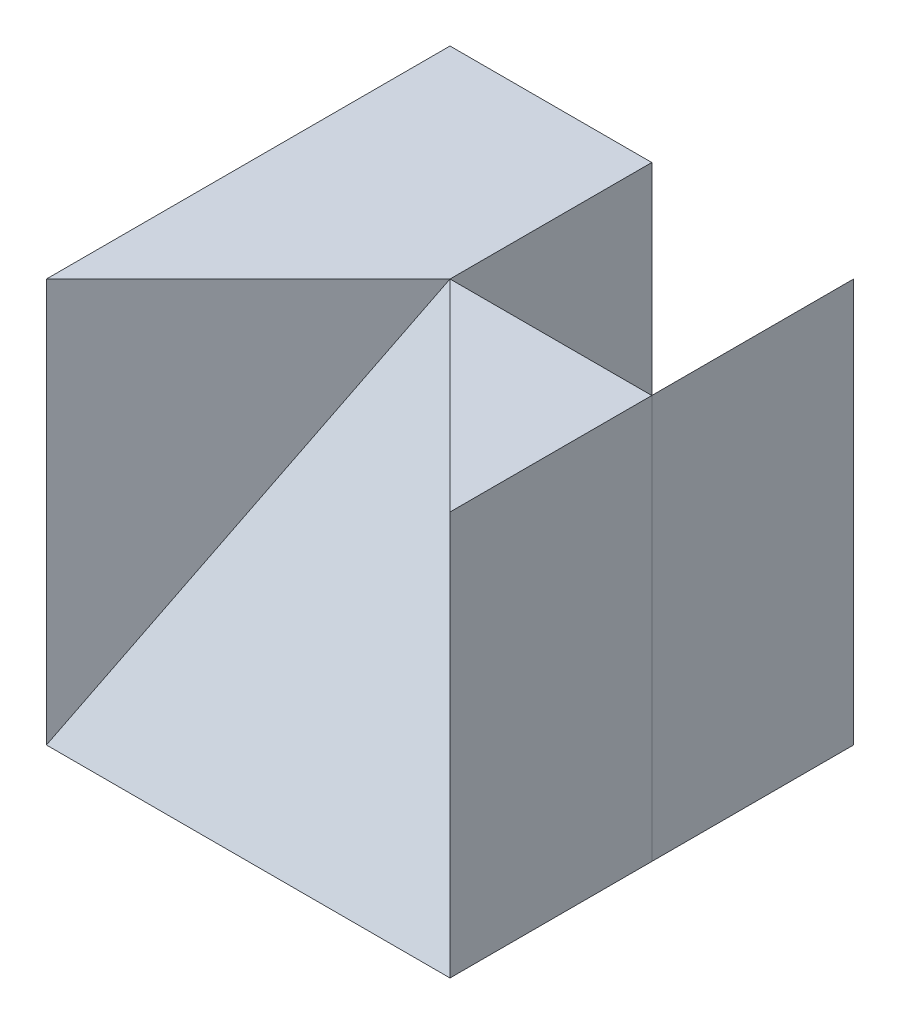
ISO-10303-21;
HEADER;
FILE_DESCRIPTION(('STEP AP214'),'2;1');
FILE_NAME('part.step','',(''),(''),'','','');
FILE_SCHEMA(('AUTOMOTIVE_DESIGN { 1 0 10303 214 1 1 1 1 }'));
ENDSEC;
DATA;
#1=APPLICATION_CONTEXT('core data for automotive mechanical design processes');
#2=APPLICATION_PROTOCOL_DEFINITION('international standard','automotive_design',2000,#1);
#3=PRODUCT_CONTEXT('',#1,'mechanical');
#4=PRODUCT('Part','Part','',(#3));
#5=PRODUCT_RELATED_PRODUCT_CATEGORY('part','',(#4));
#6=PRODUCT_DEFINITION_FORMATION('','',#4);
#7=PRODUCT_DEFINITION_CONTEXT('part definition',#1,'design');
#8=PRODUCT_DEFINITION('design','',#6,#7);
#9=PRODUCT_DEFINITION_SHAPE('','',#8);
#10=(LENGTH_UNIT() NAMED_UNIT(*) SI_UNIT(.MILLI.,.METRE.));
#11=(NAMED_UNIT(*) PLANE_ANGLE_UNIT() SI_UNIT($,.RADIAN.));
#12=(NAMED_UNIT(*) SI_UNIT($,.STERADIAN.) SOLID_ANGLE_UNIT());
#13=UNCERTAINTY_MEASURE_WITH_UNIT(LENGTH_MEASURE(1.E-05),#10,'distance_accuracy_value','');
#14=(GEOMETRIC_REPRESENTATION_CONTEXT(3) GLOBAL_UNCERTAINTY_ASSIGNED_CONTEXT((#13)) GLOBAL_UNIT_ASSIGNED_CONTEXT((#10,
#11,#12)) REPRESENTATION_CONTEXT('',''));
#15=CARTESIAN_POINT('',(0.,0.,0.));
#16=DIRECTION('',(0.,0.,1.));
#17=DIRECTION('',(1.,0.,0.));
#18=AXIS2_PLACEMENT_3D('',#15,#16,#17);
#19=CARTESIAN_POINT('',(2.,0.,-2.));
#20=DIRECTION('',(-1.,0.,0.));
#21=DIRECTION('',(0.,0.,1.));
#22=AXIS2_PLACEMENT_3D('',#19,#20,#21);
#23=PLANE('',#22);
#24=DIRECTION('',(0.,-1.,0.));
#25=VECTOR('',#24,1.);
#26=CARTESIAN_POINT('',(2.,0.,0.));
#27=LINE('',#26,#25);
#28=CARTESIAN_POINT('',(2.,4.,0.));
#29=VERTEX_POINT('',#28);
#30=CARTESIAN_POINT('',(2.,0.,0.));
#31=VERTEX_POINT('',#30);
#32=EDGE_CURVE('E93',#29,#31,#27,.T.);
#33=ORIENTED_EDGE('',*,*,#32,.T.);
#34=DIRECTION('',(0.,0.,1.));
#35=VECTOR('',#34,1.);
#36=CARTESIAN_POINT('',(2.,0.,-2.));
#37=LINE('',#36,#35);
#38=CARTESIAN_POINT('',(2.,0.,-2.));
#39=VERTEX_POINT('',#38);
#40=EDGE_CURVE('E13',#39,#31,#37,.T.);
#41=ORIENTED_EDGE('',*,*,#40,.F.);
#42=DIRECTION('',(0.,-1.,0.));
#43=VECTOR('',#42,1.);
#44=CARTESIAN_POINT('',(2.,0.,-2.));
#45=LINE('',#44,#43);
#46=CARTESIAN_POINT('',(2.,4.,-2.));
#47=VERTEX_POINT('',#46);
#48=EDGE_CURVE('E86',#47,#39,#45,.T.);
#49=ORIENTED_EDGE('',*,*,#48,.F.);
#50=DIRECTION('',(0.,0.,1.));
#51=VECTOR('',#50,1.);
#52=CARTESIAN_POINT('',(2.,4.,-2.));
#53=LINE('',#52,#51);
#54=EDGE_CURVE('E94',#47,#29,#53,.T.);
#55=ORIENTED_EDGE('',*,*,#54,.T.);
#56=EDGE_LOOP('',(#33,#41,#49,#55));
#57=FACE_BOUND('',#56,.T.);
#58=ADVANCED_FACE('F46',(#57),#23,.F.);
#59=CARTESIAN_POINT('',(0.,0.,-2.));
#60=DIRECTION('',(0.,1.,0.));
#61=DIRECTION('',(0.,0.,1.));
#62=AXIS2_PLACEMENT_3D('',#59,#60,#61);
#63=PLANE('',#62);
#64=DIRECTION('',(-1.,0.,0.));
#65=VECTOR('',#64,1.);
#66=CARTESIAN_POINT('',(0.,0.,0.));
#67=LINE('',#66,#65);
#68=CARTESIAN_POINT('',(0.,0.,0.));
#69=VERTEX_POINT('',#68);
#70=EDGE_CURVE('E74',#31,#69,#67,.T.);
#71=ORIENTED_EDGE('',*,*,#70,.T.);
#72=DIRECTION('',(0.,0.,1.));
#73=VECTOR('',#72,1.);
#74=CARTESIAN_POINT('',(0.,0.,-2.));
#75=LINE('',#74,#73);
#76=CARTESIAN_POINT('',(0.,0.,-2.));
#77=VERTEX_POINT('',#76);
#78=EDGE_CURVE('E54',#77,#69,#75,.T.);
#79=ORIENTED_EDGE('',*,*,#78,.F.);
#80=DIRECTION('',(-1.,0.,0.));
#81=VECTOR('',#80,1.);
#82=CARTESIAN_POINT('',(0.,0.,-2.));
#83=LINE('',#82,#81);
#84=EDGE_CURVE('E82',#39,#77,#83,.T.);
#85=ORIENTED_EDGE('',*,*,#84,.F.);
#86=ORIENTED_EDGE('',*,*,#40,.T.);
#87=EDGE_LOOP('',(#71,#79,#85,#86));
#88=FACE_BOUND('',#87,.T.);
#89=ADVANCED_FACE('F83',(#88),#63,.F.);
#90=CARTESIAN_POINT('',(2.,4.,-2.));
#91=DIRECTION('',(0.894427190999916,-0.447213595499958,0.));
#92=DIRECTION('',(0.447213595499958,0.894427190999916,0.));
#93=AXIS2_PLACEMENT_3D('',#90,#91,#92);
#94=PLANE('',#93);
#95=DIRECTION('',(0.447213595499958,0.894427190999916,0.));
#96=VECTOR('',#95,1.);
#97=CARTESIAN_POINT('',(2.,4.,0.));
#98=LINE('',#97,#96);
#99=EDGE_CURVE('E79',#69,#29,#98,.T.);
#100=ORIENTED_EDGE('',*,*,#99,.T.);
#101=ORIENTED_EDGE('',*,*,#54,.F.);
#102=DIRECTION('',(0.447213595499958,0.894427190999916,0.));
#103=VECTOR('',#102,1.);
#104=CARTESIAN_POINT('',(2.,4.,-2.));
#105=LINE('',#104,#103);
#106=EDGE_CURVE('E62',#77,#47,#105,.T.);
#107=ORIENTED_EDGE('',*,*,#106,.F.);
#108=ORIENTED_EDGE('',*,*,#78,.T.);
#109=EDGE_LOOP('',(#100,#101,#107,#108));
#110=FACE_BOUND('',#109,.T.);
#111=ADVANCED_FACE('F101',(#110),#94,.F.);
#112=CARTESIAN_POINT('',(0.,0.,-2.));
#113=DIRECTION('',(0.,0.,-1.));
#114=DIRECTION('',(-1.,0.,0.));
#115=AXIS2_PLACEMENT_3D('',#112,#113,#114);
#116=PLANE('',#115);
#117=ORIENTED_EDGE('',*,*,#48,.T.);
#118=ORIENTED_EDGE('',*,*,#84,.T.);
#119=ORIENTED_EDGE('',*,*,#106,.T.);
#120=EDGE_LOOP('',(#117,#118,#119));
#121=FACE_BOUND('',#120,.T.);
#122=ADVANCED_FACE('F89',(#121),#116,.T.);
#123=CARTESIAN_POINT('',(0.,0.,0.));
#124=DIRECTION('',(0.,0.,-1.));
#125=DIRECTION('',(-1.,0.,0.));
#126=AXIS2_PLACEMENT_3D('',#123,#124,#125);
#127=PLANE('',#126);
#128=ORIENTED_EDGE('',*,*,#32,.F.);
#129=ORIENTED_EDGE('',*,*,#99,.F.);
#130=ORIENTED_EDGE('',*,*,#70,.F.);
#131=EDGE_LOOP('',(#128,#129,#130));
#132=FACE_BOUND('',#131,.T.);
#133=ADVANCED_FACE('F102',(#132),#127,.F.);
#134=CLOSED_SHELL('',(#58,#89,#111,#122,#133));
#135=MANIFOLD_SOLID_BREP('B2',#134);
#136=CARTESIAN_POINT('',(0.,4.,0.));
#137=DIRECTION('',(0.,-1.,0.));
#138=DIRECTION('',(0.,0.,-1.));
#139=AXIS2_PLACEMENT_3D('',#136,#137,#138);
#140=PLANE('',#139);
#141=DIRECTION('',(-0.707106781186548,0.,0.707106781186548));
#142=VECTOR('',#141,1.);
#143=CARTESIAN_POINT('',(0.,4.,0.));
#144=LINE('',#143,#142);
#145=CARTESIAN_POINT('',(0.,4.,0.));
#146=VERTEX_POINT('',#145);
#147=CARTESIAN_POINT('',(-2.,4.,2.));
#148=VERTEX_POINT('',#147);
#149=EDGE_CURVE('E195',#146,#148,#144,.T.);
#150=ORIENTED_EDGE('',*,*,#149,.F.);
#151=DIRECTION('',(0.,0.,1.));
#152=VECTOR('',#151,1.);
#153=CARTESIAN_POINT('',(0.,4.,0.));
#154=LINE('',#153,#152);
#155=CARTESIAN_POINT('',(0.,4.,-2.));
#156=VERTEX_POINT('',#155);
#157=EDGE_CURVE('E221',#156,#146,#154,.T.);
#158=ORIENTED_EDGE('',*,*,#157,.F.);
#159=DIRECTION('',(-1.,0.,0.));
#160=VECTOR('',#159,1.);
#161=CARTESIAN_POINT('',(-2.,4.,-2.));
#162=LINE('',#161,#160);
#163=CARTESIAN_POINT('',(-2.,4.,-2.));
#164=VERTEX_POINT('',#163);
#165=EDGE_CURVE('E169',#156,#164,#162,.T.);
#166=ORIENTED_EDGE('',*,*,#165,.T.);
#167=DIRECTION('',(0.,0.,1.));
#168=VECTOR('',#167,1.);
#169=CARTESIAN_POINT('',(-2.,4.,2.));
#170=LINE('',#169,#168);
#171=EDGE_CURVE('E249',#164,#148,#170,.T.);
#172=ORIENTED_EDGE('',*,*,#171,.T.);
#173=EDGE_LOOP('',(#150,#158,#166,#172));
#174=FACE_BOUND('',#173,.T.);
#175=ADVANCED_FACE('F143',(#174),#140,.F.);
#176=DIRECTION('',(0.,0.,-1.));
#177=VECTOR('',#176,1.);
#178=CARTESIAN_POINT('',(2.,4.,2.));
#179=LINE('',#178,#177);
#180=CARTESIAN_POINT('',(2.,4.,2.));
#181=VERTEX_POINT('',#180);
#182=CARTESIAN_POINT('',(2.,4.,0.));
#183=VERTEX_POINT('',#182);
#184=EDGE_CURVE('E229',#181,#183,#179,.T.);
#185=ORIENTED_EDGE('',*,*,#184,.T.);
#186=DIRECTION('',(1.,0.,0.));
#187=VECTOR('',#186,1.);
#188=CARTESIAN_POINT('',(0.,4.,0.));
#189=LINE('',#188,#187);
#190=EDGE_CURVE('E216',#146,#183,#189,.T.);
#191=ORIENTED_EDGE('',*,*,#190,.F.);
#192=DIRECTION('',(-0.707106781186548,0.,-0.707106781186548));
#193=VECTOR('',#192,1.);
#194=CARTESIAN_POINT('',(0.,4.,0.));
#195=LINE('',#194,#193);
#196=EDGE_CURVE('E227',#181,#146,#195,.T.);
#197=ORIENTED_EDGE('',*,*,#196,.F.);
#198=EDGE_LOOP('',(#185,#191,#197));
#199=FACE_BOUND('',#198,.T.);
#200=ADVANCED_FACE('F226',(#199),#140,.F.);
#201=CARTESIAN_POINT('',(2.,4.,2.));
#202=DIRECTION('',(-1.,0.,0.));
#203=DIRECTION('',(0.,0.,1.));
#204=AXIS2_PLACEMENT_3D('',#201,#202,#203);
#205=PLANE('',#204);
#206=DIRECTION('',(0.,0.,-1.));
#207=VECTOR('',#206,1.);
#208=CARTESIAN_POINT('',(2.,0.,2.));
#209=LINE('',#208,#207);
#210=CARTESIAN_POINT('',(2.,0.,2.));
#211=VERTEX_POINT('',#210);
#212=CARTESIAN_POINT('',(2.,0.,0.));
#213=VERTEX_POINT('',#212);
#214=EDGE_CURVE('E234',#211,#213,#209,.T.);
#215=ORIENTED_EDGE('',*,*,#214,.T.);
#216=DIRECTION('',(0.,1.,0.));
#217=VECTOR('',#216,1.);
#218=CARTESIAN_POINT('',(2.,-6.,0.));
#219=LINE('',#218,#217);
#220=EDGE_CURVE('E160',#213,#183,#219,.T.);
#221=ORIENTED_EDGE('',*,*,#220,.T.);
#222=ORIENTED_EDGE('',*,*,#184,.F.);
#223=DIRECTION('',(0.,-1.,0.));
#224=VECTOR('',#223,1.);
#225=CARTESIAN_POINT('',(2.,4.,2.));
#226=LINE('',#225,#224);
#227=EDGE_CURVE('E188',#181,#211,#226,.T.);
#228=ORIENTED_EDGE('',*,*,#227,.T.);
#229=EDGE_LOOP('',(#215,#221,#222,#228));
#230=FACE_BOUND('',#229,.T.);
#231=ADVANCED_FACE('F145',(#230),#205,.F.);
#232=CARTESIAN_POINT('',(-2.,4.,-2.));
#233=DIRECTION('',(0.,0.,1.));
#234=DIRECTION('',(1.,0.,0.));
#235=AXIS2_PLACEMENT_3D('',#232,#233,#234);
#236=PLANE('',#235);
#237=ORIENTED_EDGE('',*,*,#165,.F.);
#238=DIRECTION('',(0.,1.,0.));
#239=VECTOR('',#238,1.);
#240=CARTESIAN_POINT('',(0.,-6.,-2.));
#241=LINE('',#240,#239);
#242=CARTESIAN_POINT('',(0.,0.,-2.));
#243=VERTEX_POINT('',#242);
#244=EDGE_CURVE('E223',#243,#156,#241,.T.);
#245=ORIENTED_EDGE('',*,*,#244,.F.);
#246=DIRECTION('',(-1.,0.,0.));
#247=VECTOR('',#246,1.);
#248=CARTESIAN_POINT('',(-2.,0.,-2.));
#249=LINE('',#248,#247);
#250=CARTESIAN_POINT('',(-2.,0.,-2.));
#251=VERTEX_POINT('',#250);
#252=EDGE_CURVE('E181',#243,#251,#249,.T.);
#253=ORIENTED_EDGE('',*,*,#252,.T.);
#254=DIRECTION('',(0.,-1.,0.));
#255=VECTOR('',#254,1.);
#256=CARTESIAN_POINT('',(-2.,4.,-2.));
#257=LINE('',#256,#255);
#258=EDGE_CURVE('E44',#164,#251,#257,.T.);
#259=ORIENTED_EDGE('',*,*,#258,.F.);
#260=EDGE_LOOP('',(#237,#245,#253,#259));
#261=FACE_BOUND('',#260,.T.);
#262=ADVANCED_FACE('F293',(#261),#236,.F.);
#263=CARTESIAN_POINT('',(-2.,4.,2.));
#264=DIRECTION('',(1.,0.,0.));
#265=DIRECTION('',(0.,0.,-1.));
#266=AXIS2_PLACEMENT_3D('',#263,#264,#265);
#267=PLANE('',#266);
#268=DIRECTION('',(0.,0.,1.));
#269=VECTOR('',#268,1.);
#270=CARTESIAN_POINT('',(-2.,0.,2.));
#271=LINE('',#270,#269);
#272=CARTESIAN_POINT('',(-2.,0.,2.));
#273=VERTEX_POINT('',#272);
#274=EDGE_CURVE('E261',#251,#273,#271,.T.);
#275=ORIENTED_EDGE('',*,*,#274,.T.);
#276=DIRECTION('',(0.,-1.,0.));
#277=VECTOR('',#276,1.);
#278=CARTESIAN_POINT('',(-2.,4.,2.));
#279=LINE('',#278,#277);
#280=EDGE_CURVE('E152',#148,#273,#279,.T.);
#281=ORIENTED_EDGE('',*,*,#280,.F.);
#282=ORIENTED_EDGE('',*,*,#171,.F.);
#283=ORIENTED_EDGE('',*,*,#258,.T.);
#284=EDGE_LOOP('',(#275,#281,#282,#283));
#285=FACE_BOUND('',#284,.T.);
#286=ADVANCED_FACE('F295',(#285),#267,.F.);
#287=CARTESIAN_POINT('',(0.,0.,0.));
#288=DIRECTION('',(0.,-1.,0.));
#289=DIRECTION('',(0.,0.,-1.));
#290=AXIS2_PLACEMENT_3D('',#287,#288,#289);
#291=PLANE('',#290);
#292=DIRECTION('',(0.,0.,-1.));
#293=VECTOR('',#292,1.);
#294=CARTESIAN_POINT('',(0.,0.,0.));
#295=LINE('',#294,#293);
#296=CARTESIAN_POINT('',(0.,0.,0.));
#297=VERTEX_POINT('',#296);
#298=EDGE_CURVE('E243',#297,#243,#295,.T.);
#299=ORIENTED_EDGE('',*,*,#298,.F.);
#300=DIRECTION('',(-1.,0.,0.));
#301=VECTOR('',#300,1.);
#302=CARTESIAN_POINT('',(0.,0.,0.));
#303=LINE('',#302,#301);
#304=EDGE_CURVE('E217',#213,#297,#303,.T.);
#305=ORIENTED_EDGE('',*,*,#304,.F.);
#306=ORIENTED_EDGE('',*,*,#214,.F.);
#307=DIRECTION('',(1.,0.,0.));
#308=VECTOR('',#307,1.);
#309=CARTESIAN_POINT('',(-2.,0.,2.));
#310=LINE('',#309,#308);
#311=EDGE_CURVE('E242',#273,#211,#310,.T.);
#312=ORIENTED_EDGE('',*,*,#311,.F.);
#313=ORIENTED_EDGE('',*,*,#274,.F.);
#314=ORIENTED_EDGE('',*,*,#252,.F.);
#315=EDGE_LOOP('',(#299,#305,#306,#312,#313,#314));
#316=FACE_BOUND('',#315,.T.);
#317=ADVANCED_FACE('F285',(#316),#291,.T.);
#318=CARTESIAN_POINT('',(0.,4.,0.));
#319=DIRECTION('',(-0.707106781186548,0.,0.707106781186548));
#320=DIRECTION('',(0.707106781186548,0.,0.707106781186548));
#321=AXIS2_PLACEMENT_3D('',#318,#319,#320);
#322=PLANE('',#321);
#323=ORIENTED_EDGE('',*,*,#196,.T.);
#324=DIRECTION('',(0.408248290463863,-0.816496580927726,0.408248290463863));
#325=VECTOR('',#324,1.);
#326=CARTESIAN_POINT('',(0.,4.,0.));
#327=LINE('',#326,#325);
#328=EDGE_CURVE('E233',#146,#211,#327,.T.);
#329=ORIENTED_EDGE('',*,*,#328,.T.);
#330=ORIENTED_EDGE('',*,*,#227,.F.);
#331=EDGE_LOOP('',(#323,#329,#330));
#332=FACE_BOUND('',#331,.T.);
#333=ADVANCED_FACE('F232',(#332),#322,.T.);
#334=CARTESIAN_POINT('',(-2.,0.,2.));
#335=DIRECTION('',(0.707106781186548,0.,0.707106781186548));
#336=DIRECTION('',(0.707106781186548,0.,-0.707106781186548));
#337=AXIS2_PLACEMENT_3D('',#334,#335,#336);
#338=PLANE('',#337);
#339=ORIENTED_EDGE('',*,*,#149,.T.);
#340=ORIENTED_EDGE('',*,*,#280,.T.);
#341=DIRECTION('',(0.408248290463863,0.816496580927726,-0.408248290463863));
#342=VECTOR('',#341,1.);
#343=CARTESIAN_POINT('',(-2.,0.,2.));
#344=LINE('',#343,#342);
#345=EDGE_CURVE('E239',#273,#146,#344,.T.);
#346=ORIENTED_EDGE('',*,*,#345,.T.);
#347=EDGE_LOOP('',(#339,#340,#346));
#348=FACE_BOUND('',#347,.T.);
#349=ADVANCED_FACE('F245',(#348),#338,.T.);
#350=CARTESIAN_POINT('',(0.,0.8,1.6));
#351=DIRECTION('',(0.,0.447213595499958,0.894427190999916));
#352=DIRECTION('',(0.,-0.894427190999916,0.447213595499958));
#353=AXIS2_PLACEMENT_3D('',#350,#351,#352);
#354=PLANE('',#353);
#355=ORIENTED_EDGE('',*,*,#311,.T.);
#356=ORIENTED_EDGE('',*,*,#328,.F.);
#357=ORIENTED_EDGE('',*,*,#345,.F.);
#358=EDGE_LOOP('',(#355,#356,#357));
#359=FACE_BOUND('',#358,.T.);
#360=ADVANCED_FACE('F238',(#359),#354,.T.);
#361=CARTESIAN_POINT('',(0.,-6.,0.));
#362=DIRECTION('',(-1.,0.,0.));
#363=DIRECTION('',(0.,0.,1.));
#364=AXIS2_PLACEMENT_3D('',#361,#362,#363);
#365=PLANE('',#364);
#366=ORIENTED_EDGE('',*,*,#298,.T.);
#367=ORIENTED_EDGE('',*,*,#244,.T.);
#368=ORIENTED_EDGE('',*,*,#157,.T.);
#369=DIRECTION('',(0.,1.,0.));
#370=VECTOR('',#369,1.);
#371=CARTESIAN_POINT('',(0.,-6.,0.));
#372=LINE('',#371,#370);
#373=EDGE_CURVE('E212',#297,#146,#372,.T.);
#374=ORIENTED_EDGE('',*,*,#373,.F.);
#375=EDGE_LOOP('',(#366,#367,#368,#374));
#376=FACE_BOUND('',#375,.T.);
#377=ADVANCED_FACE('F222',(#376),#365,.F.);
#378=CARTESIAN_POINT('',(0.,-6.,0.));
#379=DIRECTION('',(0.,0.,1.));
#380=DIRECTION('',(1.,0.,0.));
#381=AXIS2_PLACEMENT_3D('',#378,#379,#380);
#382=PLANE('',#381);
#383=ORIENTED_EDGE('',*,*,#304,.T.);
#384=ORIENTED_EDGE('',*,*,#373,.T.);
#385=ORIENTED_EDGE('',*,*,#190,.T.);
#386=ORIENTED_EDGE('',*,*,#220,.F.);
#387=EDGE_LOOP('',(#383,#384,#385,#386));
#388=FACE_BOUND('',#387,.T.);
#389=ADVANCED_FACE('F214',(#388),#382,.F.);
#390=CLOSED_SHELL('',(#175,#200,#231,#262,#286,#317,#333,#349,#360,#377,#389));
#391=MANIFOLD_SOLID_BREP('B7',#390);
#392=ADVANCED_BREP_SHAPE_REPRESENTATION('',(#18,#135,#391),#14);
#393=SHAPE_DEFINITION_REPRESENTATION(#9,#392);
ENDSEC;
END-ISO-10303-21;
